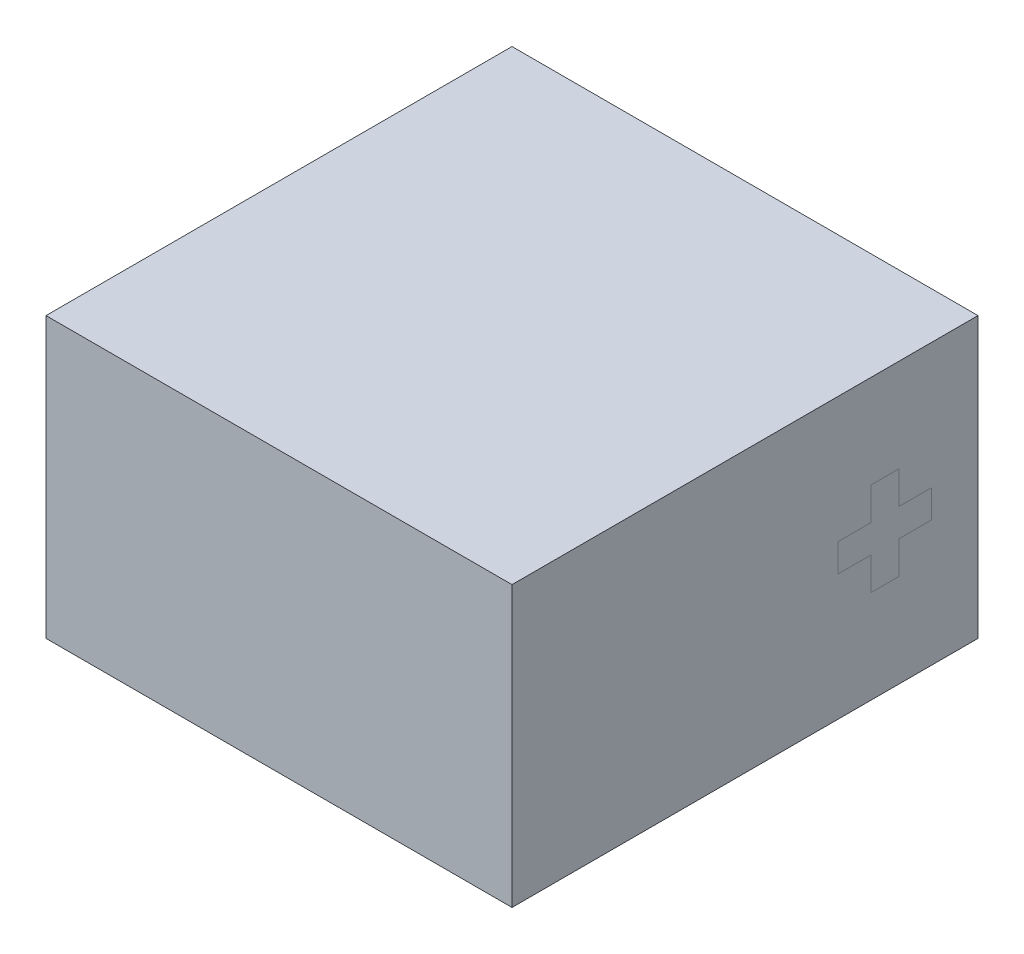
ISO-10303-21;
HEADER;
FILE_DESCRIPTION(('STEP AP214'),'2;1');
FILE_NAME('part.step','',(''),(''),'','','');
FILE_SCHEMA(('AUTOMOTIVE_DESIGN { 1 0 10303 214 1 1 1 1 }'));
ENDSEC;
DATA;
#1=APPLICATION_CONTEXT('core data for automotive mechanical design processes');
#2=APPLICATION_PROTOCOL_DEFINITION('international standard','automotive_design',2000,#1);
#3=PRODUCT_CONTEXT('',#1,'mechanical');
#4=PRODUCT('Part','Part','',(#3));
#5=PRODUCT_RELATED_PRODUCT_CATEGORY('part','',(#4));
#6=PRODUCT_DEFINITION_FORMATION('','',#4);
#7=PRODUCT_DEFINITION_CONTEXT('part definition',#1,'design');
#8=PRODUCT_DEFINITION('design','',#6,#7);
#9=PRODUCT_DEFINITION_SHAPE('','',#8);
#10=(LENGTH_UNIT() NAMED_UNIT(*) SI_UNIT(.MILLI.,.METRE.));
#11=(NAMED_UNIT(*) PLANE_ANGLE_UNIT() SI_UNIT($,.RADIAN.));
#12=(NAMED_UNIT(*) SI_UNIT($,.STERADIAN.) SOLID_ANGLE_UNIT());
#13=UNCERTAINTY_MEASURE_WITH_UNIT(LENGTH_MEASURE(1.E-05),#10,'distance_accuracy_value','');
#14=(GEOMETRIC_REPRESENTATION_CONTEXT(3) GLOBAL_UNCERTAINTY_ASSIGNED_CONTEXT((#13)) GLOBAL_UNIT_ASSIGNED_CONTEXT((#10,
#11,#12)) REPRESENTATION_CONTEXT('',''));
#15=CARTESIAN_POINT('',(0.,0.,0.));
#16=DIRECTION('',(0.,0.,1.));
#17=DIRECTION('',(1.,0.,0.));
#18=AXIS2_PLACEMENT_3D('',#15,#16,#17);
#19=CARTESIAN_POINT('',(2.5,3.,-2.5));
#20=DIRECTION('',(-1.,0.,0.));
#21=DIRECTION('',(0.,0.,1.));
#22=AXIS2_PLACEMENT_3D('',#19,#20,#21);
#23=PLANE('',#22);
#24=DIRECTION('',(0.,0.,-1.));
#25=VECTOR('',#24,1.);
#26=CARTESIAN_POINT('',(2.5,1.,-1.35));
#27=LINE('',#26,#25);
#28=CARTESIAN_POINT('',(2.5,1.,-1.35));
#29=VERTEX_POINT('',#28);
#30=CARTESIAN_POINT('',(2.5,1.,-1.65));
#31=VERTEX_POINT('',#30);
#32=EDGE_CURVE('E366',#29,#31,#27,.T.);
#33=ORIENTED_EDGE('',*,*,#32,.T.);
#34=DIRECTION('',(0.,1.,0.));
#35=VECTOR('',#34,1.);
#36=CARTESIAN_POINT('',(2.5,1.35,-1.65));
#37=LINE('',#36,#35);
#38=CARTESIAN_POINT('',(2.5,1.35,-1.65));
#39=VERTEX_POINT('',#38);
#40=EDGE_CURVE('E13',#31,#39,#37,.T.);
#41=ORIENTED_EDGE('',*,*,#40,.T.);
#42=DIRECTION('',(0.,0.,-1.));
#43=VECTOR('',#42,1.);
#44=CARTESIAN_POINT('',(2.5,1.35,-1.65));
#45=LINE('',#44,#43);
#46=CARTESIAN_POINT('',(2.5,1.35,-2.));
#47=VERTEX_POINT('',#46);
#48=EDGE_CURVE('E457',#39,#47,#45,.T.);
#49=ORIENTED_EDGE('',*,*,#48,.T.);
#50=DIRECTION('',(0.,1.,0.));
#51=VECTOR('',#50,1.);
#52=CARTESIAN_POINT('',(2.5,1.65,-2.));
#53=LINE('',#52,#51);
#54=CARTESIAN_POINT('',(2.5,1.65,-2.));
#55=VERTEX_POINT('',#54);
#56=EDGE_CURVE('E463',#47,#55,#53,.T.);
#57=ORIENTED_EDGE('',*,*,#56,.T.);
#58=DIRECTION('',(0.,0.,1.));
#59=VECTOR('',#58,1.);
#60=CARTESIAN_POINT('',(2.5,1.65,-1.65));
#61=LINE('',#60,#59);
#62=CARTESIAN_POINT('',(2.5,1.65,-1.65));
#63=VERTEX_POINT('',#62);
#64=EDGE_CURVE('E473',#55,#63,#61,.T.);
#65=ORIENTED_EDGE('',*,*,#64,.T.);
#66=DIRECTION('',(0.,1.,0.));
#67=VECTOR('',#66,1.);
#68=CARTESIAN_POINT('',(2.5,2.,-1.65));
#69=LINE('',#68,#67);
#70=CARTESIAN_POINT('',(2.5,2.,-1.65));
#71=VERTEX_POINT('',#70);
#72=EDGE_CURVE('E477',#63,#71,#69,.T.);
#73=ORIENTED_EDGE('',*,*,#72,.T.);
#74=DIRECTION('',(0.,0.,1.));
#75=VECTOR('',#74,1.);
#76=CARTESIAN_POINT('',(2.5,2.,-1.35));
#77=LINE('',#76,#75);
#78=CARTESIAN_POINT('',(2.5,2.,-1.35));
#79=VERTEX_POINT('',#78);
#80=EDGE_CURVE('E481',#71,#79,#77,.T.);
#81=ORIENTED_EDGE('',*,*,#80,.T.);
#82=DIRECTION('',(0.,-1.,0.));
#83=VECTOR('',#82,1.);
#84=CARTESIAN_POINT('',(2.5,2.,-1.35));
#85=LINE('',#84,#83);
#86=CARTESIAN_POINT('',(2.5,1.65,-1.35));
#87=VERTEX_POINT('',#86);
#88=EDGE_CURVE('E485',#79,#87,#85,.T.);
#89=ORIENTED_EDGE('',*,*,#88,.T.);
#90=DIRECTION('',(0.,0.,1.));
#91=VECTOR('',#90,1.);
#92=CARTESIAN_POINT('',(2.5,1.65,-1.));
#93=LINE('',#92,#91);
#94=CARTESIAN_POINT('',(2.5,1.65,-1.));
#95=VERTEX_POINT('',#94);
#96=EDGE_CURVE('E488',#87,#95,#93,.T.);
#97=ORIENTED_EDGE('',*,*,#96,.T.);
#98=DIRECTION('',(0.,-1.,0.));
#99=VECTOR('',#98,1.);
#100=CARTESIAN_POINT('',(2.5,1.65,-1.));
#101=LINE('',#100,#99);
#102=CARTESIAN_POINT('',(2.5,1.35,-1.));
#103=VERTEX_POINT('',#102);
#104=EDGE_CURVE('E492',#95,#103,#101,.T.);
#105=ORIENTED_EDGE('',*,*,#104,.T.);
#106=DIRECTION('',(0.,0.,-1.));
#107=VECTOR('',#106,1.);
#108=CARTESIAN_POINT('',(2.5,1.35,-1.));
#109=LINE('',#108,#107);
#110=CARTESIAN_POINT('',(2.5,1.35,-1.35));
#111=VERTEX_POINT('',#110);
#112=EDGE_CURVE('E496',#103,#111,#109,.T.);
#113=ORIENTED_EDGE('',*,*,#112,.T.);
#114=DIRECTION('',(0.,-1.,0.));
#115=VECTOR('',#114,1.);
#116=CARTESIAN_POINT('',(2.5,1.35,-1.35));
#117=LINE('',#116,#115);
#118=EDGE_CURVE('E500',#111,#29,#117,.T.);
#119=ORIENTED_EDGE('',*,*,#118,.T.);
#120=EDGE_LOOP('',(#33,#41,#49,#57,#65,#73,#81,#89,#97,#105,#113,#119));
#121=FACE_BOUND('',#120,.T.);
#122=ADVANCED_FACE('F357',(#121),#23,.F.);
#123=CARTESIAN_POINT('',(-2.5,3.,-2.5));
#124=DIRECTION('',(1.,0.,0.));
#125=DIRECTION('',(0.,0.,-1.));
#126=AXIS2_PLACEMENT_3D('',#123,#124,#125);
#127=PLANE('',#126);
#128=DIRECTION('',(0.,0.,1.));
#129=VECTOR('',#128,1.);
#130=CARTESIAN_POINT('',(-2.5,0.,-2.5));
#131=LINE('',#130,#129);
#132=CARTESIAN_POINT('',(-2.5,0.,-2.5));
#133=VERTEX_POINT('',#132);
#134=CARTESIAN_POINT('',(-2.5,0.,2.5));
#135=VERTEX_POINT('',#134);
#136=EDGE_CURVE('E455',#133,#135,#131,.T.);
#137=ORIENTED_EDGE('',*,*,#136,.T.);
#138=DIRECTION('',(0.,-1.,0.));
#139=VECTOR('',#138,1.);
#140=CARTESIAN_POINT('',(-2.5,3.,2.5));
#141=LINE('',#140,#139);
#142=CARTESIAN_POINT('',(-2.5,3.,2.5));
#143=VERTEX_POINT('',#142);
#144=EDGE_CURVE('E434',#143,#135,#141,.T.);
#145=ORIENTED_EDGE('',*,*,#144,.F.);
#146=DIRECTION('',(0.,0.,1.));
#147=VECTOR('',#146,1.);
#148=CARTESIAN_POINT('',(-2.5,3.,-2.5));
#149=LINE('',#148,#147);
#150=CARTESIAN_POINT('',(-2.5,3.,-2.5));
#151=VERTEX_POINT('',#150);
#152=EDGE_CURVE('E442',#151,#143,#149,.T.);
#153=ORIENTED_EDGE('',*,*,#152,.F.);
#154=DIRECTION('',(0.,-1.,0.));
#155=VECTOR('',#154,1.);
#156=CARTESIAN_POINT('',(-2.5,3.,-2.5));
#157=LINE('',#156,#155);
#158=EDGE_CURVE('E521',#151,#133,#157,.T.);
#159=ORIENTED_EDGE('',*,*,#158,.T.);
#160=EDGE_LOOP('',(#137,#145,#153,#159));
#161=FACE_BOUND('',#160,.T.);
#162=ADVANCED_FACE('F359',(#161),#127,.F.);
#163=CARTESIAN_POINT('',(-2.5,3.,2.5));
#164=DIRECTION('',(0.,0.,-1.));
#165=DIRECTION('',(-1.,0.,0.));
#166=AXIS2_PLACEMENT_3D('',#163,#164,#165);
#167=PLANE('',#166);
#168=DIRECTION('',(1.,0.,0.));
#169=VECTOR('',#168,1.);
#170=CARTESIAN_POINT('',(-2.5,0.,2.5));
#171=LINE('',#170,#169);
#172=CARTESIAN_POINT('',(2.5,0.,2.5));
#173=VERTEX_POINT('',#172);
#174=EDGE_CURVE('E517',#135,#173,#171,.T.);
#175=ORIENTED_EDGE('',*,*,#174,.T.);
#176=DIRECTION('',(0.,-1.,0.));
#177=VECTOR('',#176,1.);
#178=CARTESIAN_POINT('',(2.5,3.,2.5));
#179=LINE('',#178,#177);
#180=CARTESIAN_POINT('',(2.5,3.,2.5));
#181=VERTEX_POINT('',#180);
#182=EDGE_CURVE('E437',#181,#173,#179,.T.);
#183=ORIENTED_EDGE('',*,*,#182,.F.);
#184=DIRECTION('',(1.,0.,0.));
#185=VECTOR('',#184,1.);
#186=CARTESIAN_POINT('',(-2.5,3.,2.5));
#187=LINE('',#186,#185);
#188=EDGE_CURVE('E430',#143,#181,#187,.T.);
#189=ORIENTED_EDGE('',*,*,#188,.F.);
#190=ORIENTED_EDGE('',*,*,#144,.T.);
#191=EDGE_LOOP('',(#175,#183,#189,#190));
#192=FACE_BOUND('',#191,.T.);
#193=ADVANCED_FACE('F432',(#192),#167,.F.);
#194=ORIENTED_EDGE('',*,*,#40,.F.);
#195=ORIENTED_EDGE('',*,*,#32,.F.);
#196=ORIENTED_EDGE('',*,*,#118,.F.);
#197=ORIENTED_EDGE('',*,*,#112,.F.);
#198=ORIENTED_EDGE('',*,*,#104,.F.);
#199=ORIENTED_EDGE('',*,*,#96,.F.);
#200=ORIENTED_EDGE('',*,*,#88,.F.);
#201=ORIENTED_EDGE('',*,*,#80,.F.);
#202=ORIENTED_EDGE('',*,*,#72,.F.);
#203=ORIENTED_EDGE('',*,*,#64,.F.);
#204=ORIENTED_EDGE('',*,*,#56,.F.);
#205=ORIENTED_EDGE('',*,*,#48,.F.);
#206=EDGE_LOOP('',(#194,#195,#196,#197,#198,#199,#200,#201,#202,#203,#204,#205));
#207=FACE_BOUND('',#206,.T.);
#208=DIRECTION('',(0.,0.,-1.));
#209=VECTOR('',#208,1.);
#210=CARTESIAN_POINT('',(2.5,0.,-2.5));
#211=LINE('',#210,#209);
#212=CARTESIAN_POINT('',(2.5,0.,-2.5));
#213=VERTEX_POINT('',#212);
#214=EDGE_CURVE('E512',#173,#213,#211,.T.);
#215=ORIENTED_EDGE('',*,*,#214,.T.);
#216=DIRECTION('',(0.,-1.,0.));
#217=VECTOR('',#216,1.);
#218=CARTESIAN_POINT('',(2.5,3.,-2.5));
#219=LINE('',#218,#217);
#220=CARTESIAN_POINT('',(2.5,3.,-2.5));
#221=VERTEX_POINT('',#220);
#222=EDGE_CURVE('E466',#221,#213,#219,.T.);
#223=ORIENTED_EDGE('',*,*,#222,.F.);
#224=DIRECTION('',(0.,0.,-1.));
#225=VECTOR('',#224,1.);
#226=CARTESIAN_POINT('',(2.5,3.,-2.5));
#227=LINE('',#226,#225);
#228=EDGE_CURVE('E441',#181,#221,#227,.T.);
#229=ORIENTED_EDGE('',*,*,#228,.F.);
#230=ORIENTED_EDGE('',*,*,#182,.T.);
#231=EDGE_LOOP('',(#215,#223,#229,#230));
#232=FACE_BOUND('',#231,.T.);
#233=ADVANCED_FACE('F505',(#207,#232),#23,.F.);
#234=CARTESIAN_POINT('',(-2.5,3.,-2.5));
#235=DIRECTION('',(0.,0.,1.));
#236=DIRECTION('',(1.,0.,0.));
#237=AXIS2_PLACEMENT_3D('',#234,#235,#236);
#238=PLANE('',#237);
#239=DIRECTION('',(-1.,0.,0.));
#240=VECTOR('',#239,1.);
#241=CARTESIAN_POINT('',(-2.5,0.,-2.5));
#242=LINE('',#241,#240);
#243=EDGE_CURVE('E452',#213,#133,#242,.T.);
#244=ORIENTED_EDGE('',*,*,#243,.T.);
#245=ORIENTED_EDGE('',*,*,#158,.F.);
#246=DIRECTION('',(-1.,0.,0.));
#247=VECTOR('',#246,1.);
#248=CARTESIAN_POINT('',(-2.5,3.,-2.5));
#249=LINE('',#248,#247);
#250=EDGE_CURVE('E447',#221,#151,#249,.T.);
#251=ORIENTED_EDGE('',*,*,#250,.F.);
#252=ORIENTED_EDGE('',*,*,#222,.T.);
#253=EDGE_LOOP('',(#244,#245,#251,#252));
#254=FACE_BOUND('',#253,.T.);
#255=ADVANCED_FACE('F508',(#254),#238,.F.);
#256=CARTESIAN_POINT('',(0.,3.,0.));
#257=DIRECTION('',(0.,1.,0.));
#258=DIRECTION('',(0.,0.,1.));
#259=AXIS2_PLACEMENT_3D('',#256,#257,#258);
#260=PLANE('',#259);
#261=ORIENTED_EDGE('',*,*,#152,.T.);
#262=ORIENTED_EDGE('',*,*,#188,.T.);
#263=ORIENTED_EDGE('',*,*,#228,.T.);
#264=ORIENTED_EDGE('',*,*,#250,.T.);
#265=EDGE_LOOP('',(#261,#262,#263,#264));
#266=FACE_BOUND('',#265,.T.);
#267=ADVANCED_FACE('F445',(#266),#260,.T.);
#268=CARTESIAN_POINT('',(0.,0.,0.));
#269=DIRECTION('',(0.,1.,0.));
#270=DIRECTION('',(0.,0.,1.));
#271=AXIS2_PLACEMENT_3D('',#268,#269,#270);
#272=PLANE('',#271);
#273=ORIENTED_EDGE('',*,*,#136,.F.);
#274=ORIENTED_EDGE('',*,*,#243,.F.);
#275=ORIENTED_EDGE('',*,*,#214,.F.);
#276=ORIENTED_EDGE('',*,*,#174,.F.);
#277=EDGE_LOOP('',(#273,#274,#275,#276));
#278=FACE_BOUND('',#277,.T.);
#279=ADVANCED_FACE('F522',(#278),#272,.F.);
#280=CLOSED_SHELL('',(#122,#162,#193,#233,#255,#267,#279));
#281=MANIFOLD_SOLID_BREP('B2',#280);
#282=ADVANCED_BREP_SHAPE_REPRESENTATION('',(#18,#281),#14);
#283=SHAPE_DEFINITION_REPRESENTATION(#9,#282);
ENDSEC;
END-ISO-10303-21;
